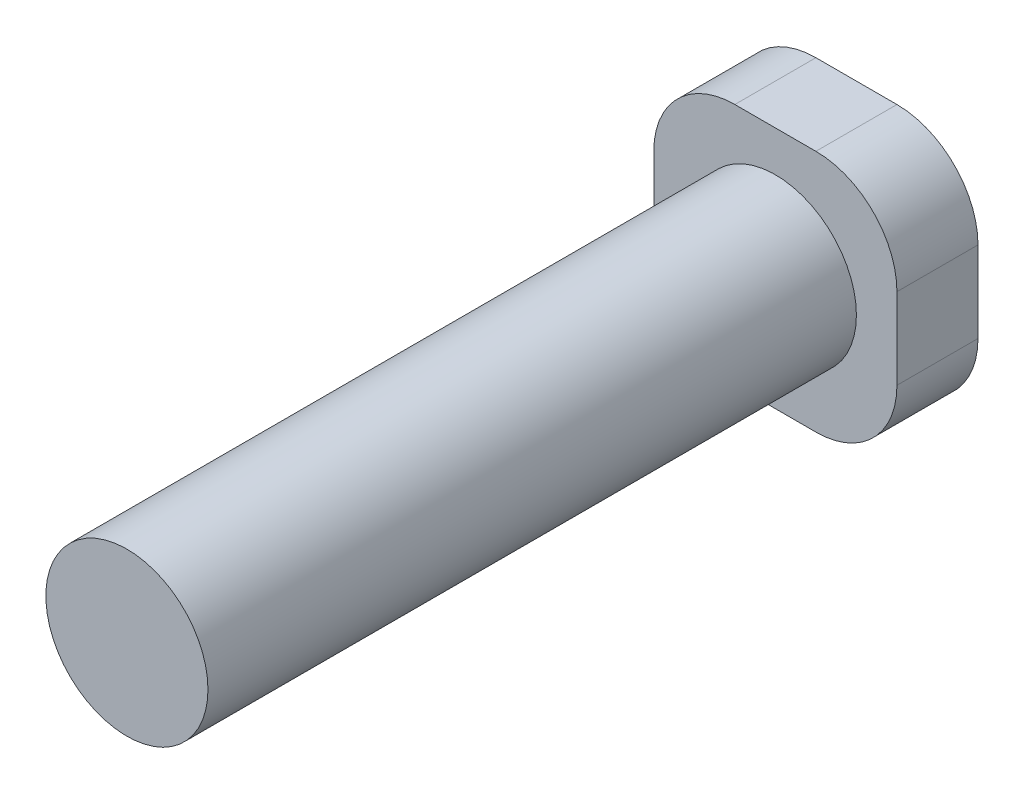
ISO-10303-21;
HEADER;
FILE_DESCRIPTION(('STEP AP214'),'2;1');
FILE_NAME('part.step','',(''),(''),'','','');
FILE_SCHEMA(('AUTOMOTIVE_DESIGN { 1 0 10303 214 1 1 1 1 }'));
ENDSEC;
DATA;
#1=APPLICATION_CONTEXT('core data for automotive mechanical design processes');
#2=APPLICATION_PROTOCOL_DEFINITION('international standard','automotive_design',2000,#1);
#3=PRODUCT_CONTEXT('',#1,'mechanical');
#4=PRODUCT('Part','Part','',(#3));
#5=PRODUCT_RELATED_PRODUCT_CATEGORY('part','',(#4));
#6=PRODUCT_DEFINITION_FORMATION('','',#4);
#7=PRODUCT_DEFINITION_CONTEXT('part definition',#1,'design');
#8=PRODUCT_DEFINITION('design','',#6,#7);
#9=PRODUCT_DEFINITION_SHAPE('','',#8);
#10=(LENGTH_UNIT() NAMED_UNIT(*) SI_UNIT(.MILLI.,.METRE.));
#11=(NAMED_UNIT(*) PLANE_ANGLE_UNIT() SI_UNIT($,.RADIAN.));
#12=(NAMED_UNIT(*) SI_UNIT($,.STERADIAN.) SOLID_ANGLE_UNIT());
#13=UNCERTAINTY_MEASURE_WITH_UNIT(LENGTH_MEASURE(1.E-05),#10,'distance_accuracy_value','');
#14=(GEOMETRIC_REPRESENTATION_CONTEXT(3) GLOBAL_UNCERTAINTY_ASSIGNED_CONTEXT((#13)) GLOBAL_UNIT_ASSIGNED_CONTEXT((#10,
#11,#12)) REPRESENTATION_CONTEXT('',''));
#15=CARTESIAN_POINT('',(0.,0.,0.));
#16=DIRECTION('',(0.,0.,1.));
#17=DIRECTION('',(1.,0.,0.));
#18=AXIS2_PLACEMENT_3D('',#15,#16,#17);
#19=CARTESIAN_POINT('',(0.5,-0.5,1.));
#20=DIRECTION('',(0.,0.,-1.));
#21=DIRECTION('',(-1.,0.,0.));
#22=AXIS2_PLACEMENT_3D('',#19,#20,#21);
#23=CYLINDRICAL_SURFACE('',#22,1.);
#24=CARTESIAN_POINT('',(0.5,-0.5,0.));
#25=DIRECTION('',(0.,0.,1.));
#26=DIRECTION('',(1.,0.,0.));
#27=AXIS2_PLACEMENT_3D('',#24,#25,#26);
#28=CIRCLE('',#27,1.);
#29=CARTESIAN_POINT('',(0.499999999999993,-1.5,0.));
#30=VERTEX_POINT('',#29);
#31=CARTESIAN_POINT('',(1.5,-0.499999999999993,0.));
#32=VERTEX_POINT('',#31);
#33=EDGE_CURVE('E142',#30,#32,#28,.T.);
#34=ORIENTED_EDGE('',*,*,#33,.T.);
#35=DIRECTION('',(0.,0.,-1.));
#36=VECTOR('',#35,1.);
#37=CARTESIAN_POINT('',(1.5,-0.499999999999993,1.));
#38=LINE('',#37,#36);
#39=CARTESIAN_POINT('',(1.5,-0.499999999999993,1.));
#40=VERTEX_POINT('',#39);
#41=EDGE_CURVE('E42',#40,#32,#38,.T.);
#42=ORIENTED_EDGE('',*,*,#41,.F.);
#43=CARTESIAN_POINT('',(0.5,-0.5,1.));
#44=DIRECTION('',(0.,0.,1.));
#45=DIRECTION('',(1.,0.,0.));
#46=AXIS2_PLACEMENT_3D('',#43,#44,#45);
#47=CIRCLE('',#46,1.);
#48=CARTESIAN_POINT('',(0.499999999999993,-1.5,1.));
#49=VERTEX_POINT('',#48);
#50=EDGE_CURVE('E165',#49,#40,#47,.T.);
#51=ORIENTED_EDGE('',*,*,#50,.F.);
#52=DIRECTION('',(0.,0.,-1.));
#53=VECTOR('',#52,1.);
#54=CARTESIAN_POINT('',(0.499999999999993,-1.5,1.));
#55=LINE('',#54,#53);
#56=EDGE_CURVE('E138',#49,#30,#55,.T.);
#57=ORIENTED_EDGE('',*,*,#56,.T.);
#58=EDGE_LOOP('',(#34,#42,#51,#57));
#59=FACE_BOUND('',#58,.T.);
#60=ADVANCED_FACE('F39',(#59),#23,.T.);
#61=CARTESIAN_POINT('',(1.5,-0.499999999999993,1.));
#62=DIRECTION('',(-1.,0.,0.));
#63=DIRECTION('',(0.,0.,1.));
#64=AXIS2_PLACEMENT_3D('',#61,#62,#63);
#65=PLANE('',#64);
#66=DIRECTION('',(0.,1.,0.));
#67=VECTOR('',#66,1.);
#68=CARTESIAN_POINT('',(1.5,-0.499999999999993,0.));
#69=LINE('',#68,#67);
#70=CARTESIAN_POINT('',(1.5,0.499999999999993,0.));
#71=VERTEX_POINT('',#70);
#72=EDGE_CURVE('E146',#32,#71,#69,.T.);
#73=ORIENTED_EDGE('',*,*,#72,.T.);
#74=DIRECTION('',(0.,0.,-1.));
#75=VECTOR('',#74,1.);
#76=CARTESIAN_POINT('',(1.5,0.499999999999993,1.));
#77=LINE('',#76,#75);
#78=CARTESIAN_POINT('',(1.5,0.499999999999993,1.));
#79=VERTEX_POINT('',#78);
#80=EDGE_CURVE('E179',#79,#71,#77,.T.);
#81=ORIENTED_EDGE('',*,*,#80,.F.);
#82=DIRECTION('',(0.,1.,0.));
#83=VECTOR('',#82,1.);
#84=CARTESIAN_POINT('',(1.5,-0.499999999999993,1.));
#85=LINE('',#84,#83);
#86=EDGE_CURVE('E101',#40,#79,#85,.T.);
#87=ORIENTED_EDGE('',*,*,#86,.F.);
#88=ORIENTED_EDGE('',*,*,#41,.T.);
#89=EDGE_LOOP('',(#73,#81,#87,#88));
#90=FACE_BOUND('',#89,.T.);
#91=ADVANCED_FACE('F187',(#90),#65,.F.);
#92=CARTESIAN_POINT('',(0.5,0.5,1.));
#93=DIRECTION('',(0.,0.,-1.));
#94=DIRECTION('',(-1.,0.,0.));
#95=AXIS2_PLACEMENT_3D('',#92,#93,#94);
#96=CYLINDRICAL_SURFACE('',#95,1.);
#97=CARTESIAN_POINT('',(0.5,0.5,0.));
#98=DIRECTION('',(0.,0.,1.));
#99=DIRECTION('',(-1.,0.,0.));
#100=AXIS2_PLACEMENT_3D('',#97,#98,#99);
#101=CIRCLE('',#100,1.);
#102=CARTESIAN_POINT('',(0.499999999999993,1.5,0.));
#103=VERTEX_POINT('',#102);
#104=EDGE_CURVE('E150',#71,#103,#101,.T.);
#105=ORIENTED_EDGE('',*,*,#104,.T.);
#106=DIRECTION('',(0.,0.,-1.));
#107=VECTOR('',#106,1.);
#108=CARTESIAN_POINT('',(0.499999999999993,1.5,1.));
#109=LINE('',#108,#107);
#110=CARTESIAN_POINT('',(0.499999999999993,1.5,1.));
#111=VERTEX_POINT('',#110);
#112=EDGE_CURVE('E176',#111,#103,#109,.T.);
#113=ORIENTED_EDGE('',*,*,#112,.F.);
#114=CARTESIAN_POINT('',(0.5,0.5,1.));
#115=DIRECTION('',(0.,0.,1.));
#116=DIRECTION('',(-1.,0.,0.));
#117=AXIS2_PLACEMENT_3D('',#114,#115,#116);
#118=CIRCLE('',#117,1.);
#119=EDGE_CURVE('E203',#79,#111,#118,.T.);
#120=ORIENTED_EDGE('',*,*,#119,.F.);
#121=ORIENTED_EDGE('',*,*,#80,.T.);
#122=EDGE_LOOP('',(#105,#113,#120,#121));
#123=FACE_BOUND('',#122,.T.);
#124=ADVANCED_FACE('F196',(#123),#96,.T.);
#125=CARTESIAN_POINT('',(-0.499999999999993,1.5,1.));
#126=DIRECTION('',(0.,-1.,0.));
#127=DIRECTION('',(0.,0.,-1.));
#128=AXIS2_PLACEMENT_3D('',#125,#126,#127);
#129=PLANE('',#128);
#130=DIRECTION('',(-1.,0.,0.));
#131=VECTOR('',#130,1.);
#132=CARTESIAN_POINT('',(-0.499999999999993,1.5,0.));
#133=LINE('',#132,#131);
#134=CARTESIAN_POINT('',(-0.499999999999993,1.5,0.));
#135=VERTEX_POINT('',#134);
#136=EDGE_CURVE('E153',#103,#135,#133,.T.);
#137=ORIENTED_EDGE('',*,*,#136,.T.);
#138=DIRECTION('',(0.,0.,-1.));
#139=VECTOR('',#138,1.);
#140=CARTESIAN_POINT('',(-0.499999999999993,1.5,1.));
#141=LINE('',#140,#139);
#142=CARTESIAN_POINT('',(-0.499999999999993,1.5,1.));
#143=VERTEX_POINT('',#142);
#144=EDGE_CURVE('E172',#143,#135,#141,.T.);
#145=ORIENTED_EDGE('',*,*,#144,.F.);
#146=DIRECTION('',(-1.,0.,0.));
#147=VECTOR('',#146,1.);
#148=CARTESIAN_POINT('',(-0.499999999999993,1.5,1.));
#149=LINE('',#148,#147);
#150=EDGE_CURVE('E201',#111,#143,#149,.T.);
#151=ORIENTED_EDGE('',*,*,#150,.F.);
#152=ORIENTED_EDGE('',*,*,#112,.T.);
#153=EDGE_LOOP('',(#137,#145,#151,#152));
#154=FACE_BOUND('',#153,.T.);
#155=ADVANCED_FACE('F199',(#154),#129,.F.);
#156=CARTESIAN_POINT('',(-0.5,0.5,1.));
#157=DIRECTION('',(0.,0.,-1.));
#158=DIRECTION('',(-1.,0.,0.));
#159=AXIS2_PLACEMENT_3D('',#156,#157,#158);
#160=CYLINDRICAL_SURFACE('',#159,1.);
#161=CARTESIAN_POINT('',(-0.5,0.5,0.));
#162=DIRECTION('',(0.,0.,1.));
#163=DIRECTION('',(-1.,0.,0.));
#164=AXIS2_PLACEMENT_3D('',#161,#162,#163);
#165=CIRCLE('',#164,1.);
#166=CARTESIAN_POINT('',(-1.5,0.499999999999993,0.));
#167=VERTEX_POINT('',#166);
#168=EDGE_CURVE('E156',#135,#167,#165,.T.);
#169=ORIENTED_EDGE('',*,*,#168,.T.);
#170=DIRECTION('',(0.,0.,-1.));
#171=VECTOR('',#170,1.);
#172=CARTESIAN_POINT('',(-1.5,0.499999999999993,1.));
#173=LINE('',#172,#171);
#174=CARTESIAN_POINT('',(-1.5,0.499999999999993,1.));
#175=VERTEX_POINT('',#174);
#176=EDGE_CURVE('E131',#175,#167,#173,.T.);
#177=ORIENTED_EDGE('',*,*,#176,.F.);
#178=CARTESIAN_POINT('',(-0.5,0.5,1.));
#179=DIRECTION('',(0.,0.,1.));
#180=DIRECTION('',(-1.,0.,0.));
#181=AXIS2_PLACEMENT_3D('',#178,#179,#180);
#182=CIRCLE('',#181,1.);
#183=EDGE_CURVE('E120',#143,#175,#182,.T.);
#184=ORIENTED_EDGE('',*,*,#183,.F.);
#185=ORIENTED_EDGE('',*,*,#144,.T.);
#186=EDGE_LOOP('',(#169,#177,#184,#185));
#187=FACE_BOUND('',#186,.T.);
#188=ADVANCED_FACE('F245',(#187),#160,.T.);
#189=CARTESIAN_POINT('',(-1.5,-0.499999999999993,1.));
#190=DIRECTION('',(1.,0.,0.));
#191=DIRECTION('',(0.,0.,-1.));
#192=AXIS2_PLACEMENT_3D('',#189,#190,#191);
#193=PLANE('',#192);
#194=DIRECTION('',(0.,-1.,0.));
#195=VECTOR('',#194,1.);
#196=CARTESIAN_POINT('',(-1.5,-0.499999999999993,0.));
#197=LINE('',#196,#195);
#198=CARTESIAN_POINT('',(-1.5,-0.5,0.));
#199=VERTEX_POINT('',#198);
#200=EDGE_CURVE('E129',#167,#199,#197,.T.);
#201=ORIENTED_EDGE('',*,*,#200,.T.);
#202=DIRECTION('',(0.,0.,-1.));
#203=VECTOR('',#202,1.);
#204=CARTESIAN_POINT('',(-1.5,-0.5,1.));
#205=LINE('',#204,#203);
#206=CARTESIAN_POINT('',(-1.5,-0.5,1.));
#207=VERTEX_POINT('',#206);
#208=EDGE_CURVE('E126',#207,#199,#205,.T.);
#209=ORIENTED_EDGE('',*,*,#208,.F.);
#210=DIRECTION('',(0.,-1.,0.));
#211=VECTOR('',#210,1.);
#212=CARTESIAN_POINT('',(-1.5,-0.499999999999993,1.));
#213=LINE('',#212,#211);
#214=EDGE_CURVE('E114',#175,#207,#213,.T.);
#215=ORIENTED_EDGE('',*,*,#214,.F.);
#216=ORIENTED_EDGE('',*,*,#176,.T.);
#217=EDGE_LOOP('',(#201,#209,#215,#216));
#218=FACE_BOUND('',#217,.T.);
#219=ADVANCED_FACE('F127',(#218),#193,.F.);
#220=CARTESIAN_POINT('',(-0.5,-0.5,1.));
#221=DIRECTION('',(0.,0.,-1.));
#222=DIRECTION('',(-1.,0.,0.));
#223=AXIS2_PLACEMENT_3D('',#220,#221,#222);
#224=CYLINDRICAL_SURFACE('',#223,1.);
#225=CARTESIAN_POINT('',(-0.5,-0.5,0.));
#226=DIRECTION('',(0.,0.,1.));
#227=DIRECTION('',(-1.,0.,0.));
#228=AXIS2_PLACEMENT_3D('',#225,#226,#227);
#229=CIRCLE('',#228,1.);
#230=CARTESIAN_POINT('',(-0.499999999999993,-1.5,0.));
#231=VERTEX_POINT('',#230);
#232=EDGE_CURVE('E86',#199,#231,#229,.T.);
#233=ORIENTED_EDGE('',*,*,#232,.T.);
#234=DIRECTION('',(0.,0.,-1.));
#235=VECTOR('',#234,1.);
#236=CARTESIAN_POINT('',(-0.499999999999993,-1.5,1.));
#237=LINE('',#236,#235);
#238=CARTESIAN_POINT('',(-0.499999999999993,-1.5,1.));
#239=VERTEX_POINT('',#238);
#240=EDGE_CURVE('E132',#239,#231,#237,.T.);
#241=ORIENTED_EDGE('',*,*,#240,.F.);
#242=CARTESIAN_POINT('',(-0.5,-0.5,1.));
#243=DIRECTION('',(0.,0.,1.));
#244=DIRECTION('',(-1.,0.,0.));
#245=AXIS2_PLACEMENT_3D('',#242,#243,#244);
#246=CIRCLE('',#245,1.);
#247=EDGE_CURVE('E118',#207,#239,#246,.T.);
#248=ORIENTED_EDGE('',*,*,#247,.F.);
#249=ORIENTED_EDGE('',*,*,#208,.T.);
#250=EDGE_LOOP('',(#233,#241,#248,#249));
#251=FACE_BOUND('',#250,.T.);
#252=ADVANCED_FACE('F134',(#251),#224,.T.);
#253=CARTESIAN_POINT('',(-0.499999999999993,-1.5,1.));
#254=DIRECTION('',(0.,1.,0.));
#255=DIRECTION('',(0.,0.,1.));
#256=AXIS2_PLACEMENT_3D('',#253,#254,#255);
#257=PLANE('',#256);
#258=DIRECTION('',(1.,0.,0.));
#259=VECTOR('',#258,1.);
#260=CARTESIAN_POINT('',(-0.499999999999993,-1.5,0.));
#261=LINE('',#260,#259);
#262=EDGE_CURVE('E92',#231,#30,#261,.T.);
#263=ORIENTED_EDGE('',*,*,#262,.T.);
#264=ORIENTED_EDGE('',*,*,#56,.F.);
#265=DIRECTION('',(1.,0.,0.));
#266=VECTOR('',#265,1.);
#267=CARTESIAN_POINT('',(-0.499999999999993,-1.5,1.));
#268=LINE('',#267,#266);
#269=EDGE_CURVE('E57',#239,#49,#268,.T.);
#270=ORIENTED_EDGE('',*,*,#269,.F.);
#271=ORIENTED_EDGE('',*,*,#240,.T.);
#272=EDGE_LOOP('',(#263,#264,#270,#271));
#273=FACE_BOUND('',#272,.T.);
#274=ADVANCED_FACE('F226',(#273),#257,.F.);
#275=CARTESIAN_POINT('',(0.5,-0.5,1.));
#276=DIRECTION('',(0.,0.,1.));
#277=DIRECTION('',(1.,0.,0.));
#278=AXIS2_PLACEMENT_3D('',#275,#276,#277);
#279=PLANE('',#278);
#280=CARTESIAN_POINT('',(0.,0.,1.));
#281=DIRECTION('',(0.,0.,1.));
#282=DIRECTION('',(1.,0.,0.));
#283=AXIS2_PLACEMENT_3D('',#280,#281,#282);
#284=CIRCLE('',#283,1.);
#285=CARTESIAN_POINT('',(1.,0.,1.));
#286=VERTEX_POINT('',#285);
#287=EDGE_CURVE('E11',#286,#286,#284,.T.);
#288=ORIENTED_EDGE('',*,*,#287,.F.);
#289=EDGE_LOOP('',(#288));
#290=FACE_BOUND('',#289,.T.);
#291=ORIENTED_EDGE('',*,*,#50,.T.);
#292=ORIENTED_EDGE('',*,*,#86,.T.);
#293=ORIENTED_EDGE('',*,*,#119,.T.);
#294=ORIENTED_EDGE('',*,*,#150,.T.);
#295=ORIENTED_EDGE('',*,*,#183,.T.);
#296=ORIENTED_EDGE('',*,*,#214,.T.);
#297=ORIENTED_EDGE('',*,*,#247,.T.);
#298=ORIENTED_EDGE('',*,*,#269,.T.);
#299=EDGE_LOOP('',(#291,#292,#293,#294,#295,#296,#297,#298));
#300=FACE_BOUND('',#299,.T.);
#301=ADVANCED_FACE('F116',(#290,#300),#279,.T.);
#302=CARTESIAN_POINT('',(0.5,-0.5,0.));
#303=DIRECTION('',(0.,0.,1.));
#304=DIRECTION('',(1.,0.,0.));
#305=AXIS2_PLACEMENT_3D('',#302,#303,#304);
#306=PLANE('',#305);
#307=ORIENTED_EDGE('',*,*,#33,.F.);
#308=ORIENTED_EDGE('',*,*,#262,.F.);
#309=ORIENTED_EDGE('',*,*,#232,.F.);
#310=ORIENTED_EDGE('',*,*,#200,.F.);
#311=ORIENTED_EDGE('',*,*,#168,.F.);
#312=ORIENTED_EDGE('',*,*,#136,.F.);
#313=ORIENTED_EDGE('',*,*,#104,.F.);
#314=ORIENTED_EDGE('',*,*,#72,.F.);
#315=EDGE_LOOP('',(#307,#308,#309,#310,#311,#312,#313,#314));
#316=FACE_BOUND('',#315,.T.);
#317=ADVANCED_FACE('F192',(#316),#306,.F.);
#318=CARTESIAN_POINT('',(0.,0.,9.));
#319=DIRECTION('',(0.,0.,-1.));
#320=DIRECTION('',(-1.,0.,0.));
#321=AXIS2_PLACEMENT_3D('',#318,#319,#320);
#322=CYLINDRICAL_SURFACE('',#321,1.);
#323=CARTESIAN_POINT('',(0.,0.,9.));
#324=DIRECTION('',(0.,0.,1.));
#325=DIRECTION('',(1.,0.,0.));
#326=AXIS2_PLACEMENT_3D('',#323,#324,#325);
#327=CIRCLE('',#326,1.);
#328=CARTESIAN_POINT('',(1.,0.,9.));
#329=VERTEX_POINT('',#328);
#330=EDGE_CURVE('E147',#329,#329,#327,.T.);
#331=ORIENTED_EDGE('',*,*,#330,.F.);
#332=EDGE_LOOP('',(#331));
#333=FACE_BOUND('',#332,.T.);
#334=ORIENTED_EDGE('',*,*,#287,.T.);
#335=EDGE_LOOP('',(#334));
#336=FACE_BOUND('',#335,.T.);
#337=ADVANCED_FACE('F219',(#333,#336),#322,.T.);
#338=CARTESIAN_POINT('',(0.,0.,9.));
#339=DIRECTION('',(0.,0.,1.));
#340=DIRECTION('',(1.,0.,0.));
#341=AXIS2_PLACEMENT_3D('',#338,#339,#340);
#342=PLANE('',#341);
#343=ORIENTED_EDGE('',*,*,#330,.T.);
#344=EDGE_LOOP('',(#343));
#345=FACE_BOUND('',#344,.T.);
#346=ADVANCED_FACE('F217',(#345),#342,.T.);
#347=CLOSED_SHELL('',(#60,#91,#124,#155,#188,#219,#252,#274,#301,#317,#337,#346));
#348=MANIFOLD_SOLID_BREP('B2',#347);
#349=ADVANCED_BREP_SHAPE_REPRESENTATION('',(#18,#348),#14);
#350=SHAPE_DEFINITION_REPRESENTATION(#9,#349);
ENDSEC;
END-ISO-10303-21;
